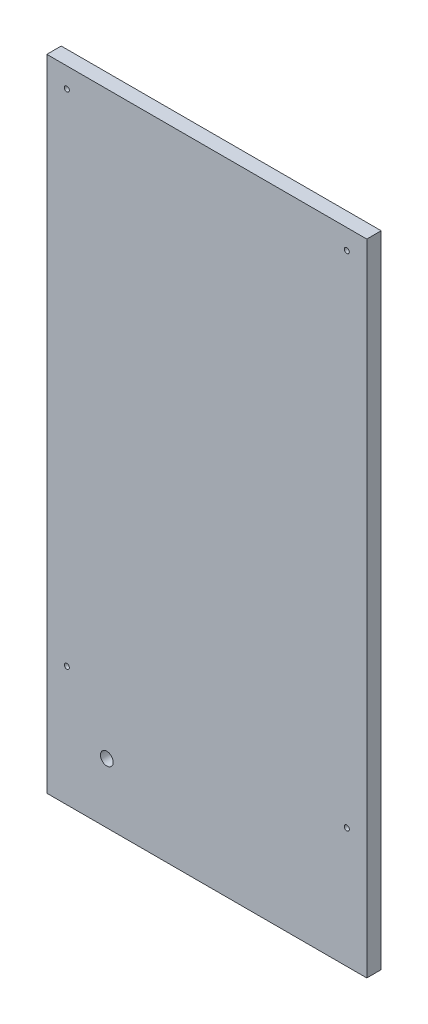
ISO-10303-21;
HEADER;
FILE_DESCRIPTION(('STEP AP214'),'2;1');
FILE_NAME('part.step','',(''),(''),'','','');
FILE_SCHEMA(('AUTOMOTIVE_DESIGN { 1 0 10303 214 1 1 1 1 }'));
ENDSEC;
DATA;
#1=APPLICATION_CONTEXT('core data for automotive mechanical design processes');
#2=APPLICATION_PROTOCOL_DEFINITION('international standard','automotive_design',2000,#1);
#3=PRODUCT_CONTEXT('',#1,'mechanical');
#4=PRODUCT('Part','Part','',(#3));
#5=PRODUCT_RELATED_PRODUCT_CATEGORY('part','',(#4));
#6=PRODUCT_DEFINITION_FORMATION('','',#4);
#7=PRODUCT_DEFINITION_CONTEXT('part definition',#1,'design');
#8=PRODUCT_DEFINITION('design','',#6,#7);
#9=PRODUCT_DEFINITION_SHAPE('','',#8);
#10=(LENGTH_UNIT() NAMED_UNIT(*) SI_UNIT(.MILLI.,.METRE.));
#11=(NAMED_UNIT(*) PLANE_ANGLE_UNIT() SI_UNIT($,.RADIAN.));
#12=(NAMED_UNIT(*) SI_UNIT($,.STERADIAN.) SOLID_ANGLE_UNIT());
#13=UNCERTAINTY_MEASURE_WITH_UNIT(LENGTH_MEASURE(1.E-05),#10,'distance_accuracy_value','');
#14=(GEOMETRIC_REPRESENTATION_CONTEXT(3) GLOBAL_UNCERTAINTY_ASSIGNED_CONTEXT((#13)) GLOBAL_UNIT_ASSIGNED_CONTEXT((#10,
#11,#12)) REPRESENTATION_CONTEXT('',''));
#15=CARTESIAN_POINT('',(0.,0.,0.));
#16=DIRECTION('',(0.,0.,1.));
#17=DIRECTION('',(1.,0.,0.));
#18=AXIS2_PLACEMENT_3D('',#15,#16,#17);
#19=CARTESIAN_POINT('',(0.,0.,18.));
#20=DIRECTION('',(1.,0.,0.));
#21=DIRECTION('',(0.,0.,-1.));
#22=AXIS2_PLACEMENT_3D('',#19,#20,#21);
#23=PLANE('',#22);
#24=DIRECTION('',(0.,-1.,0.));
#25=VECTOR('',#24,1.);
#26=CARTESIAN_POINT('',(0.,0.,0.));
#27=LINE('',#26,#25);
#28=CARTESIAN_POINT('',(0.,800.,0.));
#29=VERTEX_POINT('',#28);
#30=CARTESIAN_POINT('',(0.,0.,0.));
#31=VERTEX_POINT('',#30);
#32=EDGE_CURVE('E97',#29,#31,#27,.T.);
#33=ORIENTED_EDGE('',*,*,#32,.T.);
#34=DIRECTION('',(0.,0.,-1.));
#35=VECTOR('',#34,1.);
#36=CARTESIAN_POINT('',(0.,0.,18.));
#37=LINE('',#36,#35);
#38=CARTESIAN_POINT('',(0.,0.,18.));
#39=VERTEX_POINT('',#38);
#40=EDGE_CURVE('E11',#39,#31,#37,.T.);
#41=ORIENTED_EDGE('',*,*,#40,.F.);
#42=DIRECTION('',(0.,-1.,0.));
#43=VECTOR('',#42,1.);
#44=CARTESIAN_POINT('',(0.,0.,18.));
#45=LINE('',#44,#43);
#46=CARTESIAN_POINT('',(0.,800.,18.));
#47=VERTEX_POINT('',#46);
#48=EDGE_CURVE('E85',#47,#39,#45,.T.);
#49=ORIENTED_EDGE('',*,*,#48,.F.);
#50=DIRECTION('',(0.,0.,-1.));
#51=VECTOR('',#50,1.);
#52=CARTESIAN_POINT('',(0.,800.,18.));
#53=LINE('',#52,#51);
#54=EDGE_CURVE('E93',#47,#29,#53,.T.);
#55=ORIENTED_EDGE('',*,*,#54,.T.);
#56=EDGE_LOOP('',(#33,#41,#49,#55));
#57=FACE_BOUND('',#56,.T.);
#58=ADVANCED_FACE('F34',(#57),#23,.F.);
#59=CARTESIAN_POINT('',(0.,0.,18.));
#60=DIRECTION('',(0.,1.,0.));
#61=DIRECTION('',(0.,0.,1.));
#62=AXIS2_PLACEMENT_3D('',#59,#60,#61);
#63=PLANE('',#62);
#64=DIRECTION('',(1.,0.,0.));
#65=VECTOR('',#64,1.);
#66=CARTESIAN_POINT('',(0.,0.,0.));
#67=LINE('',#66,#65);
#68=CARTESIAN_POINT('',(400.,0.,0.));
#69=VERTEX_POINT('',#68);
#70=EDGE_CURVE('E89',#31,#69,#67,.T.);
#71=ORIENTED_EDGE('',*,*,#70,.T.);
#72=DIRECTION('',(0.,0.,-1.));
#73=VECTOR('',#72,1.);
#74=CARTESIAN_POINT('',(400.,0.,18.));
#75=LINE('',#74,#73);
#76=CARTESIAN_POINT('',(400.,0.,18.));
#77=VERTEX_POINT('',#76);
#78=EDGE_CURVE('E42',#77,#69,#75,.T.);
#79=ORIENTED_EDGE('',*,*,#78,.F.);
#80=DIRECTION('',(1.,0.,0.));
#81=VECTOR('',#80,1.);
#82=CARTESIAN_POINT('',(0.,0.,18.));
#83=LINE('',#82,#81);
#84=EDGE_CURVE('E80',#39,#77,#83,.T.);
#85=ORIENTED_EDGE('',*,*,#84,.F.);
#86=ORIENTED_EDGE('',*,*,#40,.T.);
#87=EDGE_LOOP('',(#71,#79,#85,#86));
#88=FACE_BOUND('',#87,.T.);
#89=ADVANCED_FACE('F88',(#88),#63,.F.);
#90=CARTESIAN_POINT('',(400.,0.,18.));
#91=DIRECTION('',(-1.,0.,0.));
#92=DIRECTION('',(0.,0.,1.));
#93=AXIS2_PLACEMENT_3D('',#90,#91,#92);
#94=PLANE('',#93);
#95=DIRECTION('',(0.,1.,0.));
#96=VECTOR('',#95,1.);
#97=CARTESIAN_POINT('',(400.,0.,0.));
#98=LINE('',#97,#96);
#99=CARTESIAN_POINT('',(400.,800.,0.));
#100=VERTEX_POINT('',#99);
#101=EDGE_CURVE('E67',#69,#100,#98,.T.);
#102=ORIENTED_EDGE('',*,*,#101,.T.);
#103=DIRECTION('',(0.,0.,-1.));
#104=VECTOR('',#103,1.);
#105=CARTESIAN_POINT('',(400.,800.,18.));
#106=LINE('',#105,#104);
#107=CARTESIAN_POINT('',(400.,800.,18.));
#108=VERTEX_POINT('',#107);
#109=EDGE_CURVE('E90',#108,#100,#106,.T.);
#110=ORIENTED_EDGE('',*,*,#109,.F.);
#111=DIRECTION('',(0.,1.,0.));
#112=VECTOR('',#111,1.);
#113=CARTESIAN_POINT('',(400.,0.,18.));
#114=LINE('',#113,#112);
#115=EDGE_CURVE('E83',#77,#108,#114,.T.);
#116=ORIENTED_EDGE('',*,*,#115,.F.);
#117=ORIENTED_EDGE('',*,*,#78,.T.);
#118=EDGE_LOOP('',(#102,#110,#116,#117));
#119=FACE_BOUND('',#118,.T.);
#120=ADVANCED_FACE('F91',(#119),#94,.F.);
#121=CARTESIAN_POINT('',(0.,800.,18.));
#122=DIRECTION('',(0.,-1.,0.));
#123=DIRECTION('',(0.,0.,-1.));
#124=AXIS2_PLACEMENT_3D('',#121,#122,#123);
#125=PLANE('',#124);
#126=DIRECTION('',(-1.,0.,0.));
#127=VECTOR('',#126,1.);
#128=CARTESIAN_POINT('',(0.,800.,0.));
#129=LINE('',#128,#127);
#130=EDGE_CURVE('E73',#100,#29,#129,.T.);
#131=ORIENTED_EDGE('',*,*,#130,.T.);
#132=ORIENTED_EDGE('',*,*,#54,.F.);
#133=DIRECTION('',(-1.,0.,0.));
#134=VECTOR('',#133,1.);
#135=CARTESIAN_POINT('',(0.,800.,18.));
#136=LINE('',#135,#134);
#137=EDGE_CURVE('E50',#108,#47,#136,.T.);
#138=ORIENTED_EDGE('',*,*,#137,.F.);
#139=ORIENTED_EDGE('',*,*,#109,.T.);
#140=EDGE_LOOP('',(#131,#132,#138,#139));
#141=FACE_BOUND('',#140,.T.);
#142=ADVANCED_FACE('F105',(#141),#125,.F.);
#143=CARTESIAN_POINT('',(0.,0.,18.));
#144=DIRECTION('',(0.,0.,-1.));
#145=DIRECTION('',(-1.,0.,0.));
#146=AXIS2_PLACEMENT_3D('',#143,#144,#145);
#147=PLANE('',#146);
#148=CARTESIAN_POINT('',(74.9999999999997,74.9999999999997,18.));
#149=DIRECTION('',(0.,0.,-1.));
#150=DIRECTION('',(-1.,0.,0.));
#151=AXIS2_PLACEMENT_3D('',#148,#149,#150);
#152=CIRCLE('',#151,7.99999999999999);
#153=CARTESIAN_POINT('',(66.9999999999997,74.9999999999997,18.));
#154=VERTEX_POINT('',#153);
#155=EDGE_CURVE('E121',#154,#154,#152,.F.);
#156=ORIENTED_EDGE('',*,*,#155,.F.);
#157=EDGE_LOOP('',(#156));
#158=FACE_BOUND('',#157,.T.);
#159=CARTESIAN_POINT('',(25.0000000000001,150.,18.));
#160=DIRECTION('',(0.,0.,1.));
#161=DIRECTION('',(1.,0.,0.));
#162=AXIS2_PLACEMENT_3D('',#159,#160,#161);
#163=CIRCLE('',#162,3.15000000000002);
#164=CARTESIAN_POINT('',(28.1500000000001,150.,18.));
#165=VERTEX_POINT('',#164);
#166=EDGE_CURVE('E130',#165,#165,#163,.T.);
#167=ORIENTED_EDGE('',*,*,#166,.F.);
#168=EDGE_LOOP('',(#167));
#169=FACE_BOUND('',#168,.T.);
#170=CARTESIAN_POINT('',(375.,775.,18.));
#171=DIRECTION('',(0.,0.,1.));
#172=DIRECTION('',(-1.,0.,0.));
#173=AXIS2_PLACEMENT_3D('',#170,#171,#172);
#174=CIRCLE('',#173,3.15000000000002);
#175=CARTESIAN_POINT('',(371.85,775.,18.));
#176=VERTEX_POINT('',#175);
#177=EDGE_CURVE('E124',#176,#176,#174,.T.);
#178=ORIENTED_EDGE('',*,*,#177,.F.);
#179=EDGE_LOOP('',(#178));
#180=FACE_BOUND('',#179,.T.);
#181=CARTESIAN_POINT('',(375.,150.,18.));
#182=DIRECTION('',(0.,0.,1.));
#183=DIRECTION('',(-1.,0.,0.));
#184=AXIS2_PLACEMENT_3D('',#181,#182,#183);
#185=CIRCLE('',#184,3.15000000000002);
#186=CARTESIAN_POINT('',(371.85,150.,18.));
#187=VERTEX_POINT('',#186);
#188=EDGE_CURVE('E117',#187,#187,#185,.T.);
#189=ORIENTED_EDGE('',*,*,#188,.F.);
#190=EDGE_LOOP('',(#189));
#191=FACE_BOUND('',#190,.T.);
#192=CARTESIAN_POINT('',(24.9999999999999,775.,18.));
#193=DIRECTION('',(0.,0.,1.));
#194=DIRECTION('',(1.,0.,0.));
#195=AXIS2_PLACEMENT_3D('',#192,#193,#194);
#196=CIRCLE('',#195,3.15000000000001);
#197=CARTESIAN_POINT('',(28.1499999999999,775.,18.));
#198=VERTEX_POINT('',#197);
#199=EDGE_CURVE('E111',#198,#198,#196,.T.);
#200=ORIENTED_EDGE('',*,*,#199,.F.);
#201=EDGE_LOOP('',(#200));
#202=FACE_BOUND('',#201,.T.);
#203=ORIENTED_EDGE('',*,*,#48,.T.);
#204=ORIENTED_EDGE('',*,*,#84,.T.);
#205=ORIENTED_EDGE('',*,*,#115,.T.);
#206=ORIENTED_EDGE('',*,*,#137,.T.);
#207=EDGE_LOOP('',(#203,#204,#205,#206));
#208=FACE_BOUND('',#207,.T.);
#209=ADVANCED_FACE('F81',(#158,#169,#180,#191,#202,#208),#147,.F.);
#210=CARTESIAN_POINT('',(0.,0.,0.));
#211=DIRECTION('',(0.,0.,-1.));
#212=DIRECTION('',(-1.,0.,0.));
#213=AXIS2_PLACEMENT_3D('',#210,#211,#212);
#214=PLANE('',#213);
#215=CARTESIAN_POINT('',(74.9999999999997,74.9999999999997,0.));
#216=DIRECTION('',(0.,0.,-1.));
#217=DIRECTION('',(-1.,0.,0.));
#218=AXIS2_PLACEMENT_3D('',#215,#216,#217);
#219=CIRCLE('',#218,7.99999999999999);
#220=CARTESIAN_POINT('',(66.9999999999997,74.9999999999997,0.));
#221=VERTEX_POINT('',#220);
#222=EDGE_CURVE('E137',#221,#221,#219,.T.);
#223=ORIENTED_EDGE('',*,*,#222,.F.);
#224=EDGE_LOOP('',(#223));
#225=FACE_BOUND('',#224,.T.);
#226=CARTESIAN_POINT('',(25.0000000000001,150.,0.));
#227=DIRECTION('',(0.,0.,1.));
#228=DIRECTION('',(1.,0.,0.));
#229=AXIS2_PLACEMENT_3D('',#226,#227,#228);
#230=CIRCLE('',#229,3.15000000000002);
#231=CARTESIAN_POINT('',(28.1500000000001,150.,0.));
#232=VERTEX_POINT('',#231);
#233=EDGE_CURVE('E114',#232,#232,#230,.T.);
#234=ORIENTED_EDGE('',*,*,#233,.T.);
#235=EDGE_LOOP('',(#234));
#236=FACE_BOUND('',#235,.T.);
#237=CARTESIAN_POINT('',(375.,775.,0.));
#238=DIRECTION('',(0.,0.,1.));
#239=DIRECTION('',(-1.,0.,0.));
#240=AXIS2_PLACEMENT_3D('',#237,#238,#239);
#241=CIRCLE('',#240,3.15000000000002);
#242=CARTESIAN_POINT('',(371.85,775.,0.));
#243=VERTEX_POINT('',#242);
#244=EDGE_CURVE('E127',#243,#243,#241,.T.);
#245=ORIENTED_EDGE('',*,*,#244,.T.);
#246=EDGE_LOOP('',(#245));
#247=FACE_BOUND('',#246,.T.);
#248=CARTESIAN_POINT('',(375.,150.,0.));
#249=DIRECTION('',(0.,0.,1.));
#250=DIRECTION('',(-1.,0.,0.));
#251=AXIS2_PLACEMENT_3D('',#248,#249,#250);
#252=CIRCLE('',#251,3.15000000000002);
#253=CARTESIAN_POINT('',(371.85,150.,0.));
#254=VERTEX_POINT('',#253);
#255=EDGE_CURVE('E120',#254,#254,#252,.T.);
#256=ORIENTED_EDGE('',*,*,#255,.T.);
#257=EDGE_LOOP('',(#256));
#258=FACE_BOUND('',#257,.T.);
#259=CARTESIAN_POINT('',(24.9999999999999,775.,0.));
#260=DIRECTION('',(0.,0.,1.));
#261=DIRECTION('',(1.,0.,0.));
#262=AXIS2_PLACEMENT_3D('',#259,#260,#261);
#263=CIRCLE('',#262,3.15000000000001);
#264=CARTESIAN_POINT('',(28.1499999999999,775.,0.));
#265=VERTEX_POINT('',#264);
#266=EDGE_CURVE('E100',#265,#265,#263,.T.);
#267=ORIENTED_EDGE('',*,*,#266,.T.);
#268=EDGE_LOOP('',(#267));
#269=FACE_BOUND('',#268,.T.);
#270=ORIENTED_EDGE('',*,*,#32,.F.);
#271=ORIENTED_EDGE('',*,*,#130,.F.);
#272=ORIENTED_EDGE('',*,*,#101,.F.);
#273=ORIENTED_EDGE('',*,*,#70,.F.);
#274=EDGE_LOOP('',(#270,#271,#272,#273));
#275=FACE_BOUND('',#274,.T.);
#276=ADVANCED_FACE('F108',(#225,#236,#247,#258,#269,#275),#214,.T.);
#277=CARTESIAN_POINT('',(24.9999999999999,775.,0.));
#278=DIRECTION('',(0.,0.,1.));
#279=DIRECTION('',(1.,0.,0.));
#280=AXIS2_PLACEMENT_3D('',#277,#278,#279);
#281=CYLINDRICAL_SURFACE('',#280,3.15000000000001);
#282=ORIENTED_EDGE('',*,*,#266,.F.);
#283=EDGE_LOOP('',(#282));
#284=FACE_BOUND('',#283,.T.);
#285=ORIENTED_EDGE('',*,*,#199,.T.);
#286=EDGE_LOOP('',(#285));
#287=FACE_BOUND('',#286,.T.);
#288=ADVANCED_FACE('F146',(#284,#287),#281,.F.);
#289=CARTESIAN_POINT('',(375.,150.,0.));
#290=DIRECTION('',(0.,0.,1.));
#291=DIRECTION('',(1.,0.,0.));
#292=AXIS2_PLACEMENT_3D('',#289,#290,#291);
#293=CYLINDRICAL_SURFACE('',#292,3.15000000000002);
#294=ORIENTED_EDGE('',*,*,#255,.F.);
#295=EDGE_LOOP('',(#294));
#296=FACE_BOUND('',#295,.T.);
#297=ORIENTED_EDGE('',*,*,#188,.T.);
#298=EDGE_LOOP('',(#297));
#299=FACE_BOUND('',#298,.T.);
#300=ADVANCED_FACE('F158',(#296,#299),#293,.F.);
#301=CARTESIAN_POINT('',(375.,775.,0.));
#302=DIRECTION('',(0.,0.,1.));
#303=DIRECTION('',(1.,0.,0.));
#304=AXIS2_PLACEMENT_3D('',#301,#302,#303);
#305=CYLINDRICAL_SURFACE('',#304,3.15000000000002);
#306=ORIENTED_EDGE('',*,*,#244,.F.);
#307=EDGE_LOOP('',(#306));
#308=FACE_BOUND('',#307,.T.);
#309=ORIENTED_EDGE('',*,*,#177,.T.);
#310=EDGE_LOOP('',(#309));
#311=FACE_BOUND('',#310,.T.);
#312=ADVANCED_FACE('F202',(#308,#311),#305,.F.);
#313=CARTESIAN_POINT('',(25.0000000000001,150.,0.));
#314=DIRECTION('',(0.,0.,1.));
#315=DIRECTION('',(1.,0.,0.));
#316=AXIS2_PLACEMENT_3D('',#313,#314,#315);
#317=CYLINDRICAL_SURFACE('',#316,3.15000000000002);
#318=ORIENTED_EDGE('',*,*,#233,.F.);
#319=EDGE_LOOP('',(#318));
#320=FACE_BOUND('',#319,.T.);
#321=ORIENTED_EDGE('',*,*,#166,.T.);
#322=EDGE_LOOP('',(#321));
#323=FACE_BOUND('',#322,.T.);
#324=ADVANCED_FACE('F212',(#320,#323),#317,.F.);
#325=CARTESIAN_POINT('',(74.9999999999997,74.9999999999997,18.001));
#326=DIRECTION('',(0.,0.,-1.));
#327=DIRECTION('',(-1.,0.,0.));
#328=AXIS2_PLACEMENT_3D('',#325,#326,#327);
#329=CYLINDRICAL_SURFACE('',#328,7.99999999999999);
#330=ORIENTED_EDGE('',*,*,#222,.T.);
#331=EDGE_LOOP('',(#330));
#332=FACE_BOUND('',#331,.T.);
#333=ORIENTED_EDGE('',*,*,#155,.T.);
#334=EDGE_LOOP('',(#333));
#335=FACE_BOUND('',#334,.T.);
#336=ADVANCED_FACE('F141',(#332,#335),#329,.F.);
#337=CLOSED_SHELL('',(#58,#89,#120,#142,#209,#276,#288,#300,#312,#324,#336));
#338=MANIFOLD_SOLID_BREP('B2',#337);
#339=ADVANCED_BREP_SHAPE_REPRESENTATION('',(#18,#338),#14);
#340=SHAPE_DEFINITION_REPRESENTATION(#9,#339);
ENDSEC;
END-ISO-10303-21;
